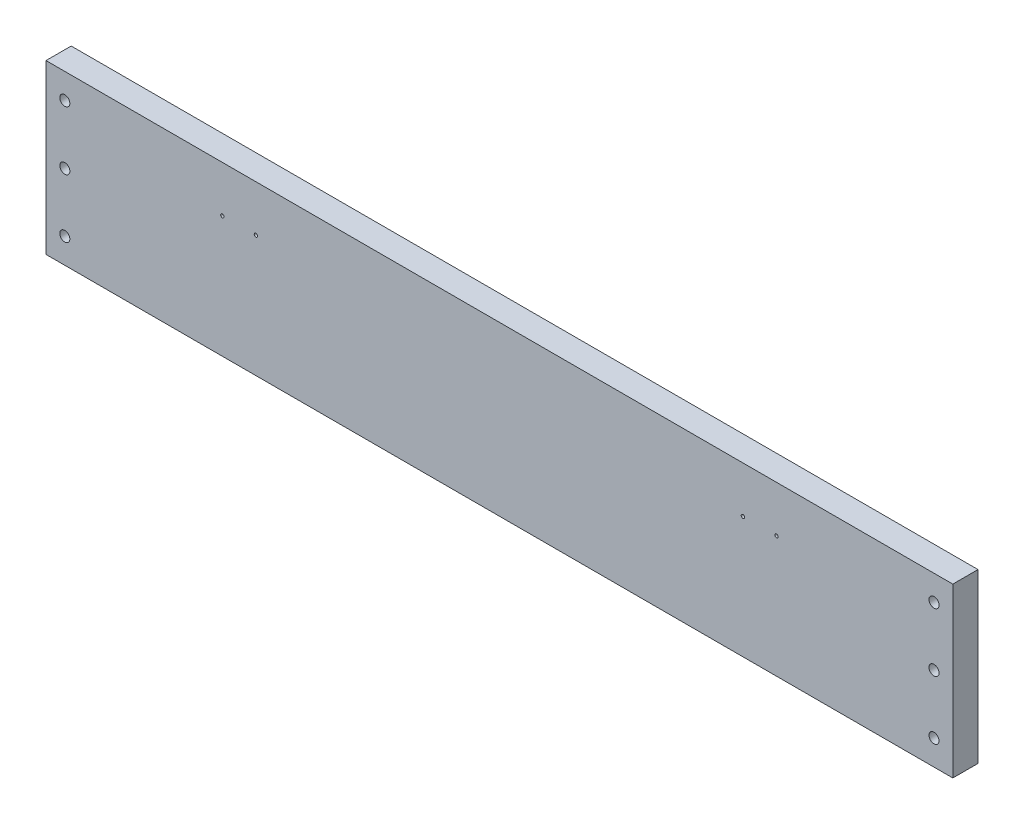
ISO-10303-21;
HEADER;
FILE_DESCRIPTION(('STEP AP214'),'2;1');
FILE_NAME('part.step','',(''),(''),'','','');
FILE_SCHEMA(('AUTOMOTIVE_DESIGN { 1 0 10303 214 1 1 1 1 }'));
ENDSEC;
DATA;
#1=APPLICATION_CONTEXT('core data for automotive mechanical design processes');
#2=APPLICATION_PROTOCOL_DEFINITION('international standard','automotive_design',2000,#1);
#3=PRODUCT_CONTEXT('',#1,'mechanical');
#4=PRODUCT('Part','Part','',(#3));
#5=PRODUCT_RELATED_PRODUCT_CATEGORY('part','',(#4));
#6=PRODUCT_DEFINITION_FORMATION('','',#4);
#7=PRODUCT_DEFINITION_CONTEXT('part definition',#1,'design');
#8=PRODUCT_DEFINITION('design','',#6,#7);
#9=PRODUCT_DEFINITION_SHAPE('','',#8);
#10=(LENGTH_UNIT() NAMED_UNIT(*) SI_UNIT(.MILLI.,.METRE.));
#11=(NAMED_UNIT(*) PLANE_ANGLE_UNIT() SI_UNIT($,.RADIAN.));
#12=(NAMED_UNIT(*) SI_UNIT($,.STERADIAN.) SOLID_ANGLE_UNIT());
#13=UNCERTAINTY_MEASURE_WITH_UNIT(LENGTH_MEASURE(1.E-05),#10,'distance_accuracy_value','');
#14=(GEOMETRIC_REPRESENTATION_CONTEXT(3) GLOBAL_UNCERTAINTY_ASSIGNED_CONTEXT((#13)) GLOBAL_UNIT_ASSIGNED_CONTEXT((#10,
#11,#12)) REPRESENTATION_CONTEXT('',''));
#15=CARTESIAN_POINT('',(0.,0.,0.));
#16=DIRECTION('',(0.,0.,1.));
#17=DIRECTION('',(1.,0.,0.));
#18=AXIS2_PLACEMENT_3D('',#15,#16,#17);
#19=CARTESIAN_POINT('',(0.,127.,0.));
#20=DIRECTION('',(0.,0.,-1.));
#21=DIRECTION('',(-1.,0.,0.));
#22=AXIS2_PLACEMENT_3D('',#19,#20,#21);
#23=PLANE('',#22);
#24=CARTESIAN_POINT('',(158.75,91.948,0.));
#25=DIRECTION('',(0.,0.,1.));
#26=DIRECTION('',(1.,0.,0.));
#27=AXIS2_PLACEMENT_3D('',#24,#25,#26);
#28=CIRCLE('',#27,1.27000000000001);
#29=CARTESIAN_POINT('',(160.02,91.948,0.));
#30=VERTEX_POINT('',#29);
#31=EDGE_CURVE('E193',#30,#30,#28,.T.);
#32=ORIENTED_EDGE('',*,*,#31,.F.);
#33=EDGE_LOOP('',(#32));
#34=FACE_BOUND('',#33,.T.);
#35=CARTESIAN_POINT('',(527.05,91.9480000000001,0.));
#36=DIRECTION('',(0.,0.,1.));
#37=DIRECTION('',(1.,0.,0.));
#38=AXIS2_PLACEMENT_3D('',#35,#36,#37);
#39=CIRCLE('',#38,1.27000000000003);
#40=CARTESIAN_POINT('',(528.32,91.9480000000001,0.));
#41=VERTEX_POINT('',#40);
#42=EDGE_CURVE('E197',#41,#41,#39,.F.);
#43=ORIENTED_EDGE('',*,*,#42,.T.);
#44=EDGE_LOOP('',(#43));
#45=FACE_BOUND('',#44,.T.);
#46=CARTESIAN_POINT('',(552.45,91.9480000000001,0.));
#47=DIRECTION('',(0.,0.,-1.));
#48=DIRECTION('',(-1.,0.,0.));
#49=AXIS2_PLACEMENT_3D('',#46,#47,#48);
#50=CIRCLE('',#49,1.27000000000003);
#51=CARTESIAN_POINT('',(551.18,91.9480000000001,0.));
#52=VERTEX_POINT('',#51);
#53=EDGE_CURVE('E201',#52,#52,#50,.T.);
#54=ORIENTED_EDGE('',*,*,#53,.T.);
#55=EDGE_LOOP('',(#54));
#56=FACE_BOUND('',#55,.T.);
#57=CARTESIAN_POINT('',(671.576,63.5,0.));
#58=DIRECTION('',(0.,0.,1.));
#59=DIRECTION('',(1.,0.,0.));
#60=AXIS2_PLACEMENT_3D('',#57,#58,#59);
#61=CIRCLE('',#60,3.80999999999999);
#62=CARTESIAN_POINT('',(675.386,63.5,0.));
#63=VERTEX_POINT('',#62);
#64=EDGE_CURVE('E136',#63,#63,#61,.F.);
#65=ORIENTED_EDGE('',*,*,#64,.T.);
#66=EDGE_LOOP('',(#65));
#67=FACE_BOUND('',#66,.T.);
#68=CARTESIAN_POINT('',(671.576,19.05,0.));
#69=DIRECTION('',(0.,0.,1.));
#70=DIRECTION('',(1.,0.,0.));
#71=AXIS2_PLACEMENT_3D('',#68,#69,#70);
#72=CIRCLE('',#71,3.80999999999999);
#73=CARTESIAN_POINT('',(675.386,19.05,0.));
#74=VERTEX_POINT('',#73);
#75=EDGE_CURVE('E143',#74,#74,#72,.F.);
#76=ORIENTED_EDGE('',*,*,#75,.T.);
#77=EDGE_LOOP('',(#76));
#78=FACE_BOUND('',#77,.T.);
#79=CARTESIAN_POINT('',(14.224,107.95,0.));
#80=DIRECTION('',(0.,0.,1.));
#81=DIRECTION('',(1.,0.,0.));
#82=AXIS2_PLACEMENT_3D('',#79,#80,#81);
#83=CIRCLE('',#82,3.81);
#84=CARTESIAN_POINT('',(18.034,107.95,0.));
#85=VERTEX_POINT('',#84);
#86=EDGE_CURVE('E155',#85,#85,#83,.T.);
#87=ORIENTED_EDGE('',*,*,#86,.F.);
#88=EDGE_LOOP('',(#87));
#89=FACE_BOUND('',#88,.T.);
#90=DIRECTION('',(1.,0.,0.));
#91=VECTOR('',#90,1.);
#92=CARTESIAN_POINT('',(0.,0.,0.));
#93=LINE('',#92,#91);
#94=CARTESIAN_POINT('',(0.,0.,0.));
#95=VERTEX_POINT('',#94);
#96=CARTESIAN_POINT('',(685.8,0.,0.));
#97=VERTEX_POINT('',#96);
#98=EDGE_CURVE('E101',#95,#97,#93,.T.);
#99=ORIENTED_EDGE('',*,*,#98,.T.);
#100=DIRECTION('',(0.,-1.,0.));
#101=VECTOR('',#100,1.);
#102=CARTESIAN_POINT('',(685.8,127.,0.));
#103=LINE('',#102,#101);
#104=CARTESIAN_POINT('',(685.8,127.,0.));
#105=VERTEX_POINT('',#104);
#106=EDGE_CURVE('E11',#105,#97,#103,.T.);
#107=ORIENTED_EDGE('',*,*,#106,.F.);
#108=DIRECTION('',(1.,0.,0.));
#109=VECTOR('',#108,1.);
#110=CARTESIAN_POINT('',(0.,127.,0.));
#111=LINE('',#110,#109);
#112=CARTESIAN_POINT('',(0.,127.,0.));
#113=VERTEX_POINT('',#112);
#114=EDGE_CURVE('E85',#113,#105,#111,.T.);
#115=ORIENTED_EDGE('',*,*,#114,.F.);
#116=DIRECTION('',(0.,-1.,0.));
#117=VECTOR('',#116,1.);
#118=CARTESIAN_POINT('',(0.,127.,0.));
#119=LINE('',#118,#117);
#120=EDGE_CURVE('E52',#113,#95,#119,.T.);
#121=ORIENTED_EDGE('',*,*,#120,.T.);
#122=EDGE_LOOP('',(#99,#107,#115,#121));
#123=FACE_BOUND('',#122,.T.);
#124=CARTESIAN_POINT('',(671.576,107.95,0.));
#125=DIRECTION('',(0.,0.,1.));
#126=DIRECTION('',(1.,0.,0.));
#127=AXIS2_PLACEMENT_3D('',#124,#125,#126);
#128=CIRCLE('',#127,3.80999999999999);
#129=CARTESIAN_POINT('',(675.386,107.95,0.));
#130=VERTEX_POINT('',#129);
#131=EDGE_CURVE('E139',#130,#130,#128,.F.);
#132=ORIENTED_EDGE('',*,*,#131,.T.);
#133=EDGE_LOOP('',(#132));
#134=FACE_BOUND('',#133,.T.);
#135=CARTESIAN_POINT('',(14.224,19.05,0.));
#136=DIRECTION('',(0.,0.,1.));
#137=DIRECTION('',(1.,0.,0.));
#138=AXIS2_PLACEMENT_3D('',#135,#136,#137);
#139=CIRCLE('',#138,3.81);
#140=CARTESIAN_POINT('',(18.034,19.05,0.));
#141=VERTEX_POINT('',#140);
#142=EDGE_CURVE('E127',#141,#141,#139,.T.);
#143=ORIENTED_EDGE('',*,*,#142,.F.);
#144=EDGE_LOOP('',(#143));
#145=FACE_BOUND('',#144,.T.);
#146=CARTESIAN_POINT('',(14.224,63.5,0.));
#147=DIRECTION('',(0.,0.,1.));
#148=DIRECTION('',(1.,0.,0.));
#149=AXIS2_PLACEMENT_3D('',#146,#147,#148);
#150=CIRCLE('',#149,3.81);
#151=CARTESIAN_POINT('',(18.034,63.5,0.));
#152=VERTEX_POINT('',#151);
#153=EDGE_CURVE('E149',#152,#152,#150,.T.);
#154=ORIENTED_EDGE('',*,*,#153,.F.);
#155=EDGE_LOOP('',(#154));
#156=FACE_BOUND('',#155,.T.);
#157=CARTESIAN_POINT('',(133.35,91.948,0.));
#158=DIRECTION('',(0.,0.,1.));
#159=DIRECTION('',(1.,0.,0.));
#160=AXIS2_PLACEMENT_3D('',#157,#158,#159);
#161=CIRCLE('',#160,1.27000000000001);
#162=CARTESIAN_POINT('',(134.62,91.948,0.));
#163=VERTEX_POINT('',#162);
#164=EDGE_CURVE('E116',#163,#163,#161,.T.);
#165=ORIENTED_EDGE('',*,*,#164,.F.);
#166=EDGE_LOOP('',(#165));
#167=FACE_BOUND('',#166,.T.);
#168=ADVANCED_FACE('F34',(#34,#45,#56,#67,#78,#89,#123,#134,#145,#156,#167),#23,.F.);
#169=CARTESIAN_POINT('',(0.,127.,-19.05));
#170=DIRECTION('',(0.,0.,1.));
#171=DIRECTION('',(1.,0.,0.));
#172=AXIS2_PLACEMENT_3D('',#169,#170,#171);
#173=PLANE('',#172);
#174=CARTESIAN_POINT('',(158.75,91.948,-19.05));
#175=DIRECTION('',(0.,0.,1.));
#176=DIRECTION('',(1.,0.,0.));
#177=AXIS2_PLACEMENT_3D('',#174,#175,#176);
#178=CIRCLE('',#177,1.27000000000001);
#179=CARTESIAN_POINT('',(160.02,91.948,-19.05));
#180=VERTEX_POINT('',#179);
#181=EDGE_CURVE('E118',#180,#180,#178,.T.);
#182=ORIENTED_EDGE('',*,*,#181,.T.);
#183=EDGE_LOOP('',(#182));
#184=FACE_BOUND('',#183,.T.);
#185=CARTESIAN_POINT('',(527.05,91.9480000000001,-19.0500000000001));
#186=DIRECTION('',(0.,0.,1.));
#187=DIRECTION('',(1.,0.,0.));
#188=AXIS2_PLACEMENT_3D('',#185,#186,#187);
#189=CIRCLE('',#188,1.27000000000003);
#190=CARTESIAN_POINT('',(528.32,91.9480000000001,-19.0500000000001));
#191=VERTEX_POINT('',#190);
#192=EDGE_CURVE('E115',#191,#191,#189,.F.);
#193=ORIENTED_EDGE('',*,*,#192,.F.);
#194=EDGE_LOOP('',(#193));
#195=FACE_BOUND('',#194,.T.);
#196=CARTESIAN_POINT('',(552.45,91.9480000000001,-19.0500000000001));
#197=DIRECTION('',(0.,0.,1.));
#198=DIRECTION('',(1.,0.,0.));
#199=AXIS2_PLACEMENT_3D('',#196,#197,#198);
#200=CIRCLE('',#199,1.27000000000003);
#201=CARTESIAN_POINT('',(553.72,91.9480000000001,-19.0500000000001));
#202=VERTEX_POINT('',#201);
#203=EDGE_CURVE('E112',#202,#202,#200,.F.);
#204=ORIENTED_EDGE('',*,*,#203,.F.);
#205=EDGE_LOOP('',(#204));
#206=FACE_BOUND('',#205,.T.);
#207=CARTESIAN_POINT('',(671.576,63.5,-19.05));
#208=DIRECTION('',(0.,0.,1.));
#209=DIRECTION('',(1.,0.,0.));
#210=AXIS2_PLACEMENT_3D('',#207,#208,#209);
#211=CIRCLE('',#210,3.80999999999999);
#212=CARTESIAN_POINT('',(675.386,63.5,-19.05));
#213=VERTEX_POINT('',#212);
#214=EDGE_CURVE('E140',#213,#213,#211,.F.);
#215=ORIENTED_EDGE('',*,*,#214,.F.);
#216=EDGE_LOOP('',(#215));
#217=FACE_BOUND('',#216,.T.);
#218=CARTESIAN_POINT('',(671.576,19.05,-19.05));
#219=DIRECTION('',(0.,0.,1.));
#220=DIRECTION('',(1.,0.,0.));
#221=AXIS2_PLACEMENT_3D('',#218,#219,#220);
#222=CIRCLE('',#221,3.80999999999999);
#223=CARTESIAN_POINT('',(675.386,19.05,-19.05));
#224=VERTEX_POINT('',#223);
#225=EDGE_CURVE('E146',#224,#224,#222,.F.);
#226=ORIENTED_EDGE('',*,*,#225,.F.);
#227=EDGE_LOOP('',(#226));
#228=FACE_BOUND('',#227,.T.);
#229=CARTESIAN_POINT('',(14.224,107.95,-19.05));
#230=DIRECTION('',(0.,0.,1.));
#231=DIRECTION('',(1.,0.,0.));
#232=AXIS2_PLACEMENT_3D('',#229,#230,#231);
#233=CIRCLE('',#232,3.81);
#234=CARTESIAN_POINT('',(18.034,107.95,-19.05));
#235=VERTEX_POINT('',#234);
#236=EDGE_CURVE('E132',#235,#235,#233,.T.);
#237=ORIENTED_EDGE('',*,*,#236,.T.);
#238=EDGE_LOOP('',(#237));
#239=FACE_BOUND('',#238,.T.);
#240=DIRECTION('',(-1.,0.,0.));
#241=VECTOR('',#240,1.);
#242=CARTESIAN_POINT('',(0.,0.,-19.05));
#243=LINE('',#242,#241);
#244=CARTESIAN_POINT('',(685.8,0.,-19.0500000000001));
#245=VERTEX_POINT('',#244);
#246=CARTESIAN_POINT('',(0.,0.,-19.05));
#247=VERTEX_POINT('',#246);
#248=EDGE_CURVE('E105',#245,#247,#243,.T.);
#249=ORIENTED_EDGE('',*,*,#248,.T.);
#250=DIRECTION('',(0.,-1.,0.));
#251=VECTOR('',#250,1.);
#252=CARTESIAN_POINT('',(0.,127.,-19.05));
#253=LINE('',#252,#251);
#254=CARTESIAN_POINT('',(0.,127.,-19.05));
#255=VERTEX_POINT('',#254);
#256=EDGE_CURVE('E67',#255,#247,#253,.T.);
#257=ORIENTED_EDGE('',*,*,#256,.F.);
#258=DIRECTION('',(-1.,0.,0.));
#259=VECTOR('',#258,1.);
#260=CARTESIAN_POINT('',(0.,127.,-19.05));
#261=LINE('',#260,#259);
#262=CARTESIAN_POINT('',(685.8,127.,-19.0500000000001));
#263=VERTEX_POINT('',#262);
#264=EDGE_CURVE('E84',#263,#255,#261,.T.);
#265=ORIENTED_EDGE('',*,*,#264,.F.);
#266=DIRECTION('',(0.,-1.,0.));
#267=VECTOR('',#266,1.);
#268=CARTESIAN_POINT('',(685.8,127.,-19.0500000000001));
#269=LINE('',#268,#267);
#270=EDGE_CURVE('E43',#263,#245,#269,.T.);
#271=ORIENTED_EDGE('',*,*,#270,.T.);
#272=EDGE_LOOP('',(#249,#257,#265,#271));
#273=FACE_BOUND('',#272,.T.);
#274=CARTESIAN_POINT('',(671.576,107.95,-19.05));
#275=DIRECTION('',(0.,0.,1.));
#276=DIRECTION('',(1.,0.,0.));
#277=AXIS2_PLACEMENT_3D('',#274,#275,#276);
#278=CIRCLE('',#277,3.80999999999999);
#279=CARTESIAN_POINT('',(675.386,107.95,-19.05));
#280=VERTEX_POINT('',#279);
#281=EDGE_CURVE('E103',#280,#280,#278,.F.);
#282=ORIENTED_EDGE('',*,*,#281,.F.);
#283=EDGE_LOOP('',(#282));
#284=FACE_BOUND('',#283,.T.);
#285=CARTESIAN_POINT('',(14.224,19.05,-19.05));
#286=DIRECTION('',(0.,0.,1.));
#287=DIRECTION('',(1.,0.,0.));
#288=AXIS2_PLACEMENT_3D('',#285,#286,#287);
#289=CIRCLE('',#288,3.81);
#290=CARTESIAN_POINT('',(18.034,19.05,-19.05));
#291=VERTEX_POINT('',#290);
#292=EDGE_CURVE('E123',#291,#291,#289,.T.);
#293=ORIENTED_EDGE('',*,*,#292,.T.);
#294=EDGE_LOOP('',(#293));
#295=FACE_BOUND('',#294,.T.);
#296=CARTESIAN_POINT('',(14.224,63.5,-19.05));
#297=DIRECTION('',(0.,0.,1.));
#298=DIRECTION('',(1.,0.,0.));
#299=AXIS2_PLACEMENT_3D('',#296,#297,#298);
#300=CIRCLE('',#299,3.81);
#301=CARTESIAN_POINT('',(18.034,63.5,-19.05));
#302=VERTEX_POINT('',#301);
#303=EDGE_CURVE('E152',#302,#302,#300,.T.);
#304=ORIENTED_EDGE('',*,*,#303,.T.);
#305=EDGE_LOOP('',(#304));
#306=FACE_BOUND('',#305,.T.);
#307=CARTESIAN_POINT('',(133.35,91.948,-19.05));
#308=DIRECTION('',(0.,0.,1.));
#309=DIRECTION('',(1.,0.,0.));
#310=AXIS2_PLACEMENT_3D('',#307,#308,#309);
#311=CIRCLE('',#310,1.27000000000001);
#312=CARTESIAN_POINT('',(134.62,91.948,-19.05));
#313=VERTEX_POINT('',#312);
#314=EDGE_CURVE('E37',#313,#313,#311,.T.);
#315=ORIENTED_EDGE('',*,*,#314,.T.);
#316=EDGE_LOOP('',(#315));
#317=FACE_BOUND('',#316,.T.);
#318=ADVANCED_FACE('F94',(#184,#195,#206,#217,#228,#239,#273,#284,#295,#306,#317),#173,.F.);
#319=CARTESIAN_POINT('',(685.8,127.,0.));
#320=DIRECTION('',(-1.,0.,0.));
#321=DIRECTION('',(0.,0.,1.));
#322=AXIS2_PLACEMENT_3D('',#319,#320,#321);
#323=PLANE('',#322);
#324=DIRECTION('',(0.,0.,-1.));
#325=VECTOR('',#324,1.);
#326=CARTESIAN_POINT('',(685.8,0.,0.));
#327=LINE('',#326,#325);
#328=EDGE_CURVE('E90',#97,#245,#327,.T.);
#329=ORIENTED_EDGE('',*,*,#328,.T.);
#330=ORIENTED_EDGE('',*,*,#270,.F.);
#331=DIRECTION('',(0.,0.,-1.));
#332=VECTOR('',#331,1.);
#333=CARTESIAN_POINT('',(685.8,127.,0.));
#334=LINE('',#333,#332);
#335=EDGE_CURVE('E78',#105,#263,#334,.T.);
#336=ORIENTED_EDGE('',*,*,#335,.F.);
#337=ORIENTED_EDGE('',*,*,#106,.T.);
#338=EDGE_LOOP('',(#329,#330,#336,#337));
#339=FACE_BOUND('',#338,.T.);
#340=ADVANCED_FACE('F89',(#339),#323,.F.);
#341=CARTESIAN_POINT('',(0.,127.,0.));
#342=DIRECTION('',(-1.,0.,0.));
#343=DIRECTION('',(0.,0.,1.));
#344=AXIS2_PLACEMENT_3D('',#341,#342,#343);
#345=PLANE('',#344);
#346=DIRECTION('',(0.,0.,-1.));
#347=VECTOR('',#346,1.);
#348=CARTESIAN_POINT('',(0.,0.,0.));
#349=LINE('',#348,#347);
#350=EDGE_CURVE('E107',#95,#247,#349,.T.);
#351=ORIENTED_EDGE('',*,*,#350,.F.);
#352=ORIENTED_EDGE('',*,*,#120,.F.);
#353=DIRECTION('',(0.,0.,-1.));
#354=VECTOR('',#353,1.);
#355=CARTESIAN_POINT('',(0.,127.,0.));
#356=LINE('',#355,#354);
#357=EDGE_CURVE('E96',#113,#255,#356,.T.);
#358=ORIENTED_EDGE('',*,*,#357,.T.);
#359=ORIENTED_EDGE('',*,*,#256,.T.);
#360=EDGE_LOOP('',(#351,#352,#358,#359));
#361=FACE_BOUND('',#360,.T.);
#362=ADVANCED_FACE('F207',(#361),#345,.T.);
#363=CARTESIAN_POINT('',(0.,127.,0.));
#364=DIRECTION('',(0.,1.,0.));
#365=DIRECTION('',(0.,0.,1.));
#366=AXIS2_PLACEMENT_3D('',#363,#364,#365);
#367=PLANE('',#366);
#368=ORIENTED_EDGE('',*,*,#114,.T.);
#369=ORIENTED_EDGE('',*,*,#335,.T.);
#370=ORIENTED_EDGE('',*,*,#264,.T.);
#371=ORIENTED_EDGE('',*,*,#357,.F.);
#372=EDGE_LOOP('',(#368,#369,#370,#371));
#373=FACE_BOUND('',#372,.T.);
#374=ADVANCED_FACE('F81',(#373),#367,.T.);
#375=CARTESIAN_POINT('',(0.,0.,0.));
#376=DIRECTION('',(0.,1.,0.));
#377=DIRECTION('',(0.,0.,1.));
#378=AXIS2_PLACEMENT_3D('',#375,#376,#377);
#379=PLANE('',#378);
#380=ORIENTED_EDGE('',*,*,#98,.F.);
#381=ORIENTED_EDGE('',*,*,#350,.T.);
#382=ORIENTED_EDGE('',*,*,#248,.F.);
#383=ORIENTED_EDGE('',*,*,#328,.F.);
#384=EDGE_LOOP('',(#380,#381,#382,#383));
#385=FACE_BOUND('',#384,.T.);
#386=ADVANCED_FACE('F170',(#385),#379,.F.);
#387=CARTESIAN_POINT('',(671.576,107.95,-19.05));
#388=DIRECTION('',(0.,0.,1.));
#389=DIRECTION('',(1.,0.,0.));
#390=AXIS2_PLACEMENT_3D('',#387,#388,#389);
#391=CYLINDRICAL_SURFACE('',#390,3.80999999999999);
#392=ORIENTED_EDGE('',*,*,#281,.T.);
#393=EDGE_LOOP('',(#392));
#394=FACE_BOUND('',#393,.T.);
#395=ORIENTED_EDGE('',*,*,#131,.F.);
#396=EDGE_LOOP('',(#395));
#397=FACE_BOUND('',#396,.T.);
#398=ADVANCED_FACE('F167',(#394,#397),#391,.F.);
#399=CARTESIAN_POINT('',(14.224,19.05,-19.05));
#400=DIRECTION('',(0.,0.,1.));
#401=DIRECTION('',(1.,0.,0.));
#402=AXIS2_PLACEMENT_3D('',#399,#400,#401);
#403=CYLINDRICAL_SURFACE('',#402,3.81);
#404=ORIENTED_EDGE('',*,*,#292,.F.);
#405=EDGE_LOOP('',(#404));
#406=FACE_BOUND('',#405,.T.);
#407=ORIENTED_EDGE('',*,*,#142,.T.);
#408=EDGE_LOOP('',(#407));
#409=FACE_BOUND('',#408,.T.);
#410=ADVANCED_FACE('F169',(#406,#409),#403,.F.);
#411=CARTESIAN_POINT('',(14.224,107.95,-19.05));
#412=DIRECTION('',(0.,0.,1.));
#413=DIRECTION('',(1.,0.,0.));
#414=AXIS2_PLACEMENT_3D('',#411,#412,#413);
#415=CYLINDRICAL_SURFACE('',#414,3.81);
#416=ORIENTED_EDGE('',*,*,#236,.F.);
#417=EDGE_LOOP('',(#416));
#418=FACE_BOUND('',#417,.T.);
#419=ORIENTED_EDGE('',*,*,#86,.T.);
#420=EDGE_LOOP('',(#419));
#421=FACE_BOUND('',#420,.T.);
#422=ADVANCED_FACE('F177',(#418,#421),#415,.F.);
#423=CARTESIAN_POINT('',(14.224,63.5,-19.05));
#424=DIRECTION('',(0.,0.,1.));
#425=DIRECTION('',(1.,0.,0.));
#426=AXIS2_PLACEMENT_3D('',#423,#424,#425);
#427=CYLINDRICAL_SURFACE('',#426,3.81);
#428=ORIENTED_EDGE('',*,*,#303,.F.);
#429=EDGE_LOOP('',(#428));
#430=FACE_BOUND('',#429,.T.);
#431=ORIENTED_EDGE('',*,*,#153,.T.);
#432=EDGE_LOOP('',(#431));
#433=FACE_BOUND('',#432,.T.);
#434=ADVANCED_FACE('F278',(#430,#433),#427,.F.);
#435=CARTESIAN_POINT('',(671.576,19.05,-19.05));
#436=DIRECTION('',(0.,0.,1.));
#437=DIRECTION('',(1.,0.,0.));
#438=AXIS2_PLACEMENT_3D('',#435,#436,#437);
#439=CYLINDRICAL_SURFACE('',#438,3.80999999999999);
#440=ORIENTED_EDGE('',*,*,#225,.T.);
#441=EDGE_LOOP('',(#440));
#442=FACE_BOUND('',#441,.T.);
#443=ORIENTED_EDGE('',*,*,#75,.F.);
#444=EDGE_LOOP('',(#443));
#445=FACE_BOUND('',#444,.T.);
#446=ADVANCED_FACE('F274',(#442,#445),#439,.F.);
#447=CARTESIAN_POINT('',(671.576,63.5,-19.05));
#448=DIRECTION('',(0.,0.,1.));
#449=DIRECTION('',(1.,0.,0.));
#450=AXIS2_PLACEMENT_3D('',#447,#448,#449);
#451=CYLINDRICAL_SURFACE('',#450,3.80999999999999);
#452=ORIENTED_EDGE('',*,*,#214,.T.);
#453=EDGE_LOOP('',(#452));
#454=FACE_BOUND('',#453,.T.);
#455=ORIENTED_EDGE('',*,*,#64,.F.);
#456=EDGE_LOOP('',(#455));
#457=FACE_BOUND('',#456,.T.);
#458=ADVANCED_FACE('F235',(#454,#457),#451,.F.);
#459=CARTESIAN_POINT('',(552.45,91.9480000000001,-114.3));
#460=DIRECTION('',(0.,0.,1.));
#461=DIRECTION('',(1.,0.,0.));
#462=AXIS2_PLACEMENT_3D('',#459,#460,#461);
#463=CYLINDRICAL_SURFACE('',#462,1.27000000000003);
#464=ORIENTED_EDGE('',*,*,#53,.F.);
#465=EDGE_LOOP('',(#464));
#466=FACE_BOUND('',#465,.T.);
#467=ORIENTED_EDGE('',*,*,#203,.T.);
#468=EDGE_LOOP('',(#467));
#469=FACE_BOUND('',#468,.T.);
#470=ADVANCED_FACE('F229',(#466,#469),#463,.F.);
#471=CARTESIAN_POINT('',(527.05,91.9480000000001,-114.3));
#472=DIRECTION('',(0.,0.,1.));
#473=DIRECTION('',(1.,0.,0.));
#474=AXIS2_PLACEMENT_3D('',#471,#472,#473);
#475=CYLINDRICAL_SURFACE('',#474,1.27000000000003);
#476=ORIENTED_EDGE('',*,*,#42,.F.);
#477=EDGE_LOOP('',(#476));
#478=FACE_BOUND('',#477,.T.);
#479=ORIENTED_EDGE('',*,*,#192,.T.);
#480=EDGE_LOOP('',(#479));
#481=FACE_BOUND('',#480,.T.);
#482=ADVANCED_FACE('F234',(#478,#481),#475,.F.);
#483=CARTESIAN_POINT('',(158.75,91.948,-114.3));
#484=DIRECTION('',(0.,0.,1.));
#485=DIRECTION('',(1.,0.,0.));
#486=AXIS2_PLACEMENT_3D('',#483,#484,#485);
#487=CYLINDRICAL_SURFACE('',#486,1.27000000000001);
#488=ORIENTED_EDGE('',*,*,#31,.T.);
#489=EDGE_LOOP('',(#488));
#490=FACE_BOUND('',#489,.T.);
#491=ORIENTED_EDGE('',*,*,#181,.F.);
#492=EDGE_LOOP('',(#491));
#493=FACE_BOUND('',#492,.T.);
#494=ADVANCED_FACE('F246',(#490,#493),#487,.F.);
#495=CARTESIAN_POINT('',(133.35,91.948,-114.3));
#496=DIRECTION('',(0.,0.,1.));
#497=DIRECTION('',(1.,0.,0.));
#498=AXIS2_PLACEMENT_3D('',#495,#496,#497);
#499=CYLINDRICAL_SURFACE('',#498,1.27000000000001);
#500=ORIENTED_EDGE('',*,*,#164,.T.);
#501=EDGE_LOOP('',(#500));
#502=FACE_BOUND('',#501,.T.);
#503=ORIENTED_EDGE('',*,*,#314,.F.);
#504=EDGE_LOOP('',(#503));
#505=FACE_BOUND('',#504,.T.);
#506=ADVANCED_FACE('F256',(#502,#505),#499,.F.);
#507=CLOSED_SHELL('',(#168,#318,#340,#362,#374,#386,#398,#410,#422,#434,#446,#458,#470,#482,
#494,#506));
#508=MANIFOLD_SOLID_BREP('B2',#507);
#509=ADVANCED_BREP_SHAPE_REPRESENTATION('',(#18,#508),#14);
#510=SHAPE_DEFINITION_REPRESENTATION(#9,#509);
ENDSEC;
END-ISO-10303-21;
